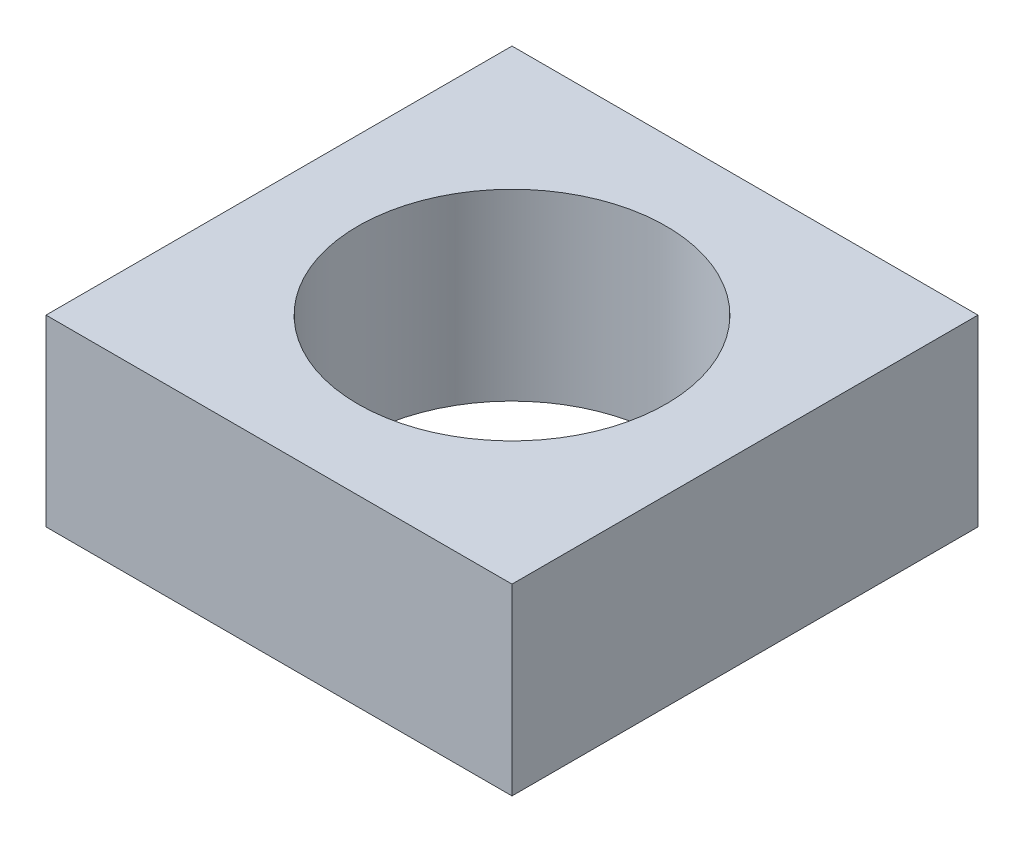
ISO-10303-21;
HEADER;
FILE_DESCRIPTION(('STEP AP214'),'2;1');
FILE_NAME('part.step','',(''),(''),'','','');
FILE_SCHEMA(('AUTOMOTIVE_DESIGN { 1 0 10303 214 1 1 1 1 }'));
ENDSEC;
DATA;
#1=APPLICATION_CONTEXT('core data for automotive mechanical design processes');
#2=APPLICATION_PROTOCOL_DEFINITION('international standard','automotive_design',2000,#1);
#3=PRODUCT_CONTEXT('',#1,'mechanical');
#4=PRODUCT('Part','Part','',(#3));
#5=PRODUCT_RELATED_PRODUCT_CATEGORY('part','',(#4));
#6=PRODUCT_DEFINITION_FORMATION('','',#4);
#7=PRODUCT_DEFINITION_CONTEXT('part definition',#1,'design');
#8=PRODUCT_DEFINITION('design','',#6,#7);
#9=PRODUCT_DEFINITION_SHAPE('','',#8);
#10=(LENGTH_UNIT() NAMED_UNIT(*) SI_UNIT(.MILLI.,.METRE.));
#11=(NAMED_UNIT(*) PLANE_ANGLE_UNIT() SI_UNIT($,.RADIAN.));
#12=(NAMED_UNIT(*) SI_UNIT($,.STERADIAN.) SOLID_ANGLE_UNIT());
#13=UNCERTAINTY_MEASURE_WITH_UNIT(LENGTH_MEASURE(1.E-05),#10,'distance_accuracy_value','');
#14=(GEOMETRIC_REPRESENTATION_CONTEXT(3) GLOBAL_UNCERTAINTY_ASSIGNED_CONTEXT((#13)) GLOBAL_UNIT_ASSIGNED_CONTEXT((#10,
#11,#12)) REPRESENTATION_CONTEXT('',''));
#15=CARTESIAN_POINT('',(0.,0.,0.));
#16=DIRECTION('',(0.,0.,1.));
#17=DIRECTION('',(1.,0.,0.));
#18=AXIS2_PLACEMENT_3D('',#15,#16,#17);
#19=CARTESIAN_POINT('',(0.,5.,0.));
#20=DIRECTION('',(0.,-1.,0.));
#21=DIRECTION('',(0.,0.,-1.));
#22=AXIS2_PLACEMENT_3D('',#19,#20,#21);
#23=PLANE('',#22);
#24=DIRECTION('',(0.,0.,-1.));
#25=VECTOR('',#24,1.);
#26=CARTESIAN_POINT('',(6.35,5.,6.35));
#27=LINE('',#26,#25);
#28=CARTESIAN_POINT('',(6.35,5.,6.35));
#29=VERTEX_POINT('',#28);
#30=CARTESIAN_POINT('',(6.35,5.,-6.35));
#31=VERTEX_POINT('',#30);
#32=EDGE_CURVE('E89',#29,#31,#27,.T.);
#33=ORIENTED_EDGE('',*,*,#32,.T.);
#34=DIRECTION('',(-1.,0.,0.));
#35=VECTOR('',#34,1.);
#36=CARTESIAN_POINT('',(-6.35,5.,-6.35));
#37=LINE('',#36,#35);
#38=CARTESIAN_POINT('',(-6.35,5.,-6.35));
#39=VERTEX_POINT('',#38);
#40=EDGE_CURVE('E84',#31,#39,#37,.T.);
#41=ORIENTED_EDGE('',*,*,#40,.T.);
#42=DIRECTION('',(0.,0.,1.));
#43=VECTOR('',#42,1.);
#44=CARTESIAN_POINT('',(-6.35,5.,6.35));
#45=LINE('',#44,#43);
#46=CARTESIAN_POINT('',(-6.35,5.,6.35));
#47=VERTEX_POINT('',#46);
#48=EDGE_CURVE('E87',#39,#47,#45,.T.);
#49=ORIENTED_EDGE('',*,*,#48,.T.);
#50=DIRECTION('',(1.,0.,0.));
#51=VECTOR('',#50,1.);
#52=CARTESIAN_POINT('',(-6.35,5.,6.35));
#53=LINE('',#52,#51);
#54=EDGE_CURVE('E54',#47,#29,#53,.T.);
#55=ORIENTED_EDGE('',*,*,#54,.T.);
#56=EDGE_LOOP('',(#33,#41,#49,#55));
#57=FACE_BOUND('',#56,.T.);
#58=CARTESIAN_POINT('',(0.,5.,0.));
#59=DIRECTION('',(0.,1.,0.));
#60=DIRECTION('',(0.,0.,1.));
#61=AXIS2_PLACEMENT_3D('',#58,#59,#60);
#62=CIRCLE('',#61,4.2);
#63=CARTESIAN_POINT('',(0.,5.,4.2));
#64=VERTEX_POINT('',#63);
#65=EDGE_CURVE('E104',#64,#64,#62,.T.);
#66=ORIENTED_EDGE('',*,*,#65,.F.);
#67=EDGE_LOOP('',(#66));
#68=FACE_BOUND('',#67,.T.);
#69=ADVANCED_FACE('F37',(#57,#68),#23,.F.);
#70=CARTESIAN_POINT('',(0.,0.,0.));
#71=DIRECTION('',(0.,-1.,0.));
#72=DIRECTION('',(0.,0.,-1.));
#73=AXIS2_PLACEMENT_3D('',#70,#71,#72);
#74=PLANE('',#73);
#75=DIRECTION('',(0.,0.,-1.));
#76=VECTOR('',#75,1.);
#77=CARTESIAN_POINT('',(6.35,0.,6.35));
#78=LINE('',#77,#76);
#79=CARTESIAN_POINT('',(6.35,0.,6.35));
#80=VERTEX_POINT('',#79);
#81=CARTESIAN_POINT('',(6.35,0.,-6.35));
#82=VERTEX_POINT('',#81);
#83=EDGE_CURVE('E101',#80,#82,#78,.T.);
#84=ORIENTED_EDGE('',*,*,#83,.F.);
#85=DIRECTION('',(1.,0.,0.));
#86=VECTOR('',#85,1.);
#87=CARTESIAN_POINT('',(-6.35,0.,6.35));
#88=LINE('',#87,#86);
#89=CARTESIAN_POINT('',(-6.35,0.,6.35));
#90=VERTEX_POINT('',#89);
#91=EDGE_CURVE('E77',#90,#80,#88,.T.);
#92=ORIENTED_EDGE('',*,*,#91,.F.);
#93=DIRECTION('',(0.,0.,1.));
#94=VECTOR('',#93,1.);
#95=CARTESIAN_POINT('',(-6.35,0.,6.35));
#96=LINE('',#95,#94);
#97=CARTESIAN_POINT('',(-6.35,0.,-6.35));
#98=VERTEX_POINT('',#97);
#99=EDGE_CURVE('E71',#98,#90,#96,.T.);
#100=ORIENTED_EDGE('',*,*,#99,.F.);
#101=DIRECTION('',(-1.,0.,0.));
#102=VECTOR('',#101,1.);
#103=CARTESIAN_POINT('',(-6.35,0.,-6.35));
#104=LINE('',#103,#102);
#105=EDGE_CURVE('E93',#82,#98,#104,.T.);
#106=ORIENTED_EDGE('',*,*,#105,.F.);
#107=EDGE_LOOP('',(#84,#92,#100,#106));
#108=FACE_BOUND('',#107,.T.);
#109=CARTESIAN_POINT('',(0.,0.,0.));
#110=DIRECTION('',(0.,1.,0.));
#111=DIRECTION('',(0.,0.,1.));
#112=AXIS2_PLACEMENT_3D('',#109,#110,#111);
#113=CIRCLE('',#112,4.2);
#114=CARTESIAN_POINT('',(0.,0.,4.2));
#115=VERTEX_POINT('',#114);
#116=EDGE_CURVE('E116',#115,#115,#113,.T.);
#117=ORIENTED_EDGE('',*,*,#116,.T.);
#118=EDGE_LOOP('',(#117));
#119=FACE_BOUND('',#118,.T.);
#120=ADVANCED_FACE('F112',(#108,#119),#74,.T.);
#121=CARTESIAN_POINT('',(6.35,5.,6.35));
#122=DIRECTION('',(-1.,0.,0.));
#123=DIRECTION('',(0.,0.,1.));
#124=AXIS2_PLACEMENT_3D('',#121,#122,#123);
#125=PLANE('',#124);
#126=ORIENTED_EDGE('',*,*,#83,.T.);
#127=DIRECTION('',(0.,-1.,0.));
#128=VECTOR('',#127,1.);
#129=CARTESIAN_POINT('',(6.35,5.,-6.35));
#130=LINE('',#129,#128);
#131=EDGE_CURVE('E11',#31,#82,#130,.T.);
#132=ORIENTED_EDGE('',*,*,#131,.F.);
#133=ORIENTED_EDGE('',*,*,#32,.F.);
#134=DIRECTION('',(0.,-1.,0.));
#135=VECTOR('',#134,1.);
#136=CARTESIAN_POINT('',(6.35,5.,6.35));
#137=LINE('',#136,#135);
#138=EDGE_CURVE('E97',#29,#80,#137,.T.);
#139=ORIENTED_EDGE('',*,*,#138,.T.);
#140=EDGE_LOOP('',(#126,#132,#133,#139));
#141=FACE_BOUND('',#140,.T.);
#142=ADVANCED_FACE('F39',(#141),#125,.F.);
#143=CARTESIAN_POINT('',(-6.35,5.,-6.35));
#144=DIRECTION('',(0.,0.,1.));
#145=DIRECTION('',(1.,0.,0.));
#146=AXIS2_PLACEMENT_3D('',#143,#144,#145);
#147=PLANE('',#146);
#148=ORIENTED_EDGE('',*,*,#105,.T.);
#149=DIRECTION('',(0.,-1.,0.));
#150=VECTOR('',#149,1.);
#151=CARTESIAN_POINT('',(-6.35,5.,-6.35));
#152=LINE('',#151,#150);
#153=EDGE_CURVE('E46',#39,#98,#152,.T.);
#154=ORIENTED_EDGE('',*,*,#153,.F.);
#155=ORIENTED_EDGE('',*,*,#40,.F.);
#156=ORIENTED_EDGE('',*,*,#131,.T.);
#157=EDGE_LOOP('',(#148,#154,#155,#156));
#158=FACE_BOUND('',#157,.T.);
#159=ADVANCED_FACE('F92',(#158),#147,.F.);
#160=CARTESIAN_POINT('',(-6.35,5.,6.35));
#161=DIRECTION('',(1.,0.,0.));
#162=DIRECTION('',(0.,0.,-1.));
#163=AXIS2_PLACEMENT_3D('',#160,#161,#162);
#164=PLANE('',#163);
#165=ORIENTED_EDGE('',*,*,#99,.T.);
#166=DIRECTION('',(0.,-1.,0.));
#167=VECTOR('',#166,1.);
#168=CARTESIAN_POINT('',(-6.35,5.,6.35));
#169=LINE('',#168,#167);
#170=EDGE_CURVE('E94',#47,#90,#169,.T.);
#171=ORIENTED_EDGE('',*,*,#170,.F.);
#172=ORIENTED_EDGE('',*,*,#48,.F.);
#173=ORIENTED_EDGE('',*,*,#153,.T.);
#174=EDGE_LOOP('',(#165,#171,#172,#173));
#175=FACE_BOUND('',#174,.T.);
#176=ADVANCED_FACE('F95',(#175),#164,.F.);
#177=CARTESIAN_POINT('',(-6.35,5.,6.35));
#178=DIRECTION('',(0.,0.,-1.));
#179=DIRECTION('',(-1.,0.,0.));
#180=AXIS2_PLACEMENT_3D('',#177,#178,#179);
#181=PLANE('',#180);
#182=ORIENTED_EDGE('',*,*,#91,.T.);
#183=ORIENTED_EDGE('',*,*,#138,.F.);
#184=ORIENTED_EDGE('',*,*,#54,.F.);
#185=ORIENTED_EDGE('',*,*,#170,.T.);
#186=EDGE_LOOP('',(#182,#183,#184,#185));
#187=FACE_BOUND('',#186,.T.);
#188=ADVANCED_FACE('F109',(#187),#181,.F.);
#189=CARTESIAN_POINT('',(0.,5.,0.));
#190=DIRECTION('',(0.,-1.,0.));
#191=DIRECTION('',(0.,0.,-1.));
#192=AXIS2_PLACEMENT_3D('',#189,#190,#191);
#193=CYLINDRICAL_SURFACE('',#192,4.2);
#194=ORIENTED_EDGE('',*,*,#65,.T.);
#195=EDGE_LOOP('',(#194));
#196=FACE_BOUND('',#195,.T.);
#197=ORIENTED_EDGE('',*,*,#116,.F.);
#198=EDGE_LOOP('',(#197));
#199=FACE_BOUND('',#198,.T.);
#200=ADVANCED_FACE('F122',(#196,#199),#193,.F.);
#201=CLOSED_SHELL('',(#69,#120,#142,#159,#176,#188,#200));
#202=MANIFOLD_SOLID_BREP('B2',#201);
#203=ADVANCED_BREP_SHAPE_REPRESENTATION('',(#18,#202),#14);
#204=SHAPE_DEFINITION_REPRESENTATION(#9,#203);
ENDSEC;
END-ISO-10303-21;
